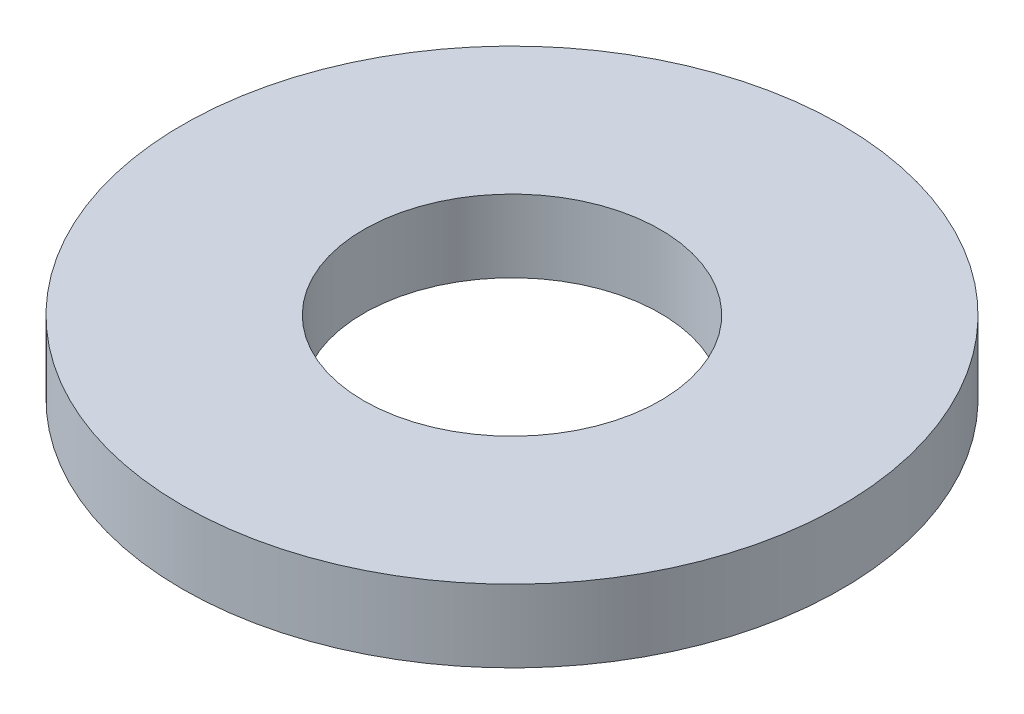
ISO-10303-21;
HEADER;
FILE_DESCRIPTION(('STEP AP214'),'2;1');
FILE_NAME('part.step','',(''),(''),'','','');
FILE_SCHEMA(('AUTOMOTIVE_DESIGN { 1 0 10303 214 1 1 1 1 }'));
ENDSEC;
DATA;
#1=APPLICATION_CONTEXT('core data for automotive mechanical design processes');
#2=APPLICATION_PROTOCOL_DEFINITION('international standard','automotive_design',2000,#1);
#3=PRODUCT_CONTEXT('',#1,'mechanical');
#4=PRODUCT('Part','Part','',(#3));
#5=PRODUCT_RELATED_PRODUCT_CATEGORY('part','',(#4));
#6=PRODUCT_DEFINITION_FORMATION('','',#4);
#7=PRODUCT_DEFINITION_CONTEXT('part definition',#1,'design');
#8=PRODUCT_DEFINITION('design','',#6,#7);
#9=PRODUCT_DEFINITION_SHAPE('','',#8);
#10=(LENGTH_UNIT() NAMED_UNIT(*) SI_UNIT(.MILLI.,.METRE.));
#11=(NAMED_UNIT(*) PLANE_ANGLE_UNIT() SI_UNIT($,.RADIAN.));
#12=(NAMED_UNIT(*) SI_UNIT($,.STERADIAN.) SOLID_ANGLE_UNIT());
#13=UNCERTAINTY_MEASURE_WITH_UNIT(LENGTH_MEASURE(1.E-05),#10,'distance_accuracy_value','');
#14=(GEOMETRIC_REPRESENTATION_CONTEXT(3) GLOBAL_UNCERTAINTY_ASSIGNED_CONTEXT((#13)) GLOBAL_UNIT_ASSIGNED_CONTEXT((#10,
#11,#12)) REPRESENTATION_CONTEXT('',''));
#15=CARTESIAN_POINT('',(0.,0.,0.));
#16=DIRECTION('',(0.,0.,1.));
#17=DIRECTION('',(1.,0.,0.));
#18=AXIS2_PLACEMENT_3D('',#15,#16,#17);
#19=CARTESIAN_POINT('',(0.,22.,0.));
#20=DIRECTION('',(0.,-1.,0.));
#21=DIRECTION('',(0.,0.,-1.));
#22=AXIS2_PLACEMENT_3D('',#19,#20,#21);
#23=CYLINDRICAL_SURFACE('',#22,100.);
#24=CARTESIAN_POINT('',(0.,22.,0.));
#25=DIRECTION('',(0.,1.,0.));
#26=DIRECTION('',(0.,0.,1.));
#27=AXIS2_PLACEMENT_3D('',#24,#25,#26);
#28=CIRCLE('',#27,100.);
#29=CARTESIAN_POINT('',(0.,22.,100.));
#30=VERTEX_POINT('',#29);
#31=EDGE_CURVE('E10',#30,#30,#28,.T.);
#32=ORIENTED_EDGE('',*,*,#31,.F.);
#33=EDGE_LOOP('',(#32));
#34=FACE_BOUND('',#33,.T.);
#35=CARTESIAN_POINT('',(0.,0.,0.));
#36=DIRECTION('',(0.,1.,0.));
#37=DIRECTION('',(0.,0.,1.));
#38=AXIS2_PLACEMENT_3D('',#35,#36,#37);
#39=CIRCLE('',#38,100.);
#40=CARTESIAN_POINT('',(0.,0.,100.));
#41=VERTEX_POINT('',#40);
#42=EDGE_CURVE('E37',#41,#41,#39,.T.);
#43=ORIENTED_EDGE('',*,*,#42,.T.);
#44=EDGE_LOOP('',(#43));
#45=FACE_BOUND('',#44,.T.);
#46=ADVANCED_FACE('F40',(#34,#45),#23,.T.);
#47=CARTESIAN_POINT('',(0.,22.,0.));
#48=DIRECTION('',(0.,1.,0.));
#49=DIRECTION('',(0.,0.,1.));
#50=AXIS2_PLACEMENT_3D('',#47,#48,#49);
#51=PLANE('',#50);
#52=CARTESIAN_POINT('',(0.,22.,0.));
#53=DIRECTION('',(0.,1.,0.));
#54=DIRECTION('',(0.,0.,1.));
#55=AXIS2_PLACEMENT_3D('',#52,#53,#54);
#56=CIRCLE('',#55,45.);
#57=CARTESIAN_POINT('',(0.,22.,45.));
#58=VERTEX_POINT('',#57);
#59=EDGE_CURVE('E50',#58,#58,#56,.T.);
#60=ORIENTED_EDGE('',*,*,#59,.F.);
#61=EDGE_LOOP('',(#60));
#62=FACE_BOUND('',#61,.T.);
#63=ORIENTED_EDGE('',*,*,#31,.T.);
#64=EDGE_LOOP('',(#63));
#65=FACE_BOUND('',#64,.T.);
#66=ADVANCED_FACE('F59',(#62,#65),#51,.T.);
#67=CARTESIAN_POINT('',(0.,0.,0.));
#68=DIRECTION('',(0.,1.,0.));
#69=DIRECTION('',(0.,0.,1.));
#70=AXIS2_PLACEMENT_3D('',#67,#68,#69);
#71=PLANE('',#70);
#72=CARTESIAN_POINT('',(0.,0.,0.));
#73=DIRECTION('',(0.,1.,0.));
#74=DIRECTION('',(0.,0.,1.));
#75=AXIS2_PLACEMENT_3D('',#72,#73,#74);
#76=CIRCLE('',#75,45.);
#77=CARTESIAN_POINT('',(0.,0.,45.));
#78=VERTEX_POINT('',#77);
#79=EDGE_CURVE('E47',#78,#78,#76,.T.);
#80=ORIENTED_EDGE('',*,*,#79,.T.);
#81=EDGE_LOOP('',(#80));
#82=FACE_BOUND('',#81,.T.);
#83=ORIENTED_EDGE('',*,*,#42,.F.);
#84=EDGE_LOOP('',(#83));
#85=FACE_BOUND('',#84,.T.);
#86=ADVANCED_FACE('F58',(#82,#85),#71,.F.);
#87=CARTESIAN_POINT('',(0.,22.,0.));
#88=DIRECTION('',(0.,-1.,0.));
#89=DIRECTION('',(0.,0.,-1.));
#90=AXIS2_PLACEMENT_3D('',#87,#88,#89);
#91=CYLINDRICAL_SURFACE('',#90,45.);
#92=ORIENTED_EDGE('',*,*,#59,.T.);
#93=EDGE_LOOP('',(#92));
#94=FACE_BOUND('',#93,.T.);
#95=ORIENTED_EDGE('',*,*,#79,.F.);
#96=EDGE_LOOP('',(#95));
#97=FACE_BOUND('',#96,.T.);
#98=ADVANCED_FACE('F54',(#94,#97),#91,.F.);
#99=CLOSED_SHELL('',(#46,#66,#86,#98));
#100=MANIFOLD_SOLID_BREP('B2',#99);
#101=ADVANCED_BREP_SHAPE_REPRESENTATION('',(#18,#100),#14);
#102=SHAPE_DEFINITION_REPRESENTATION(#9,#101);
ENDSEC;
END-ISO-10303-21;
